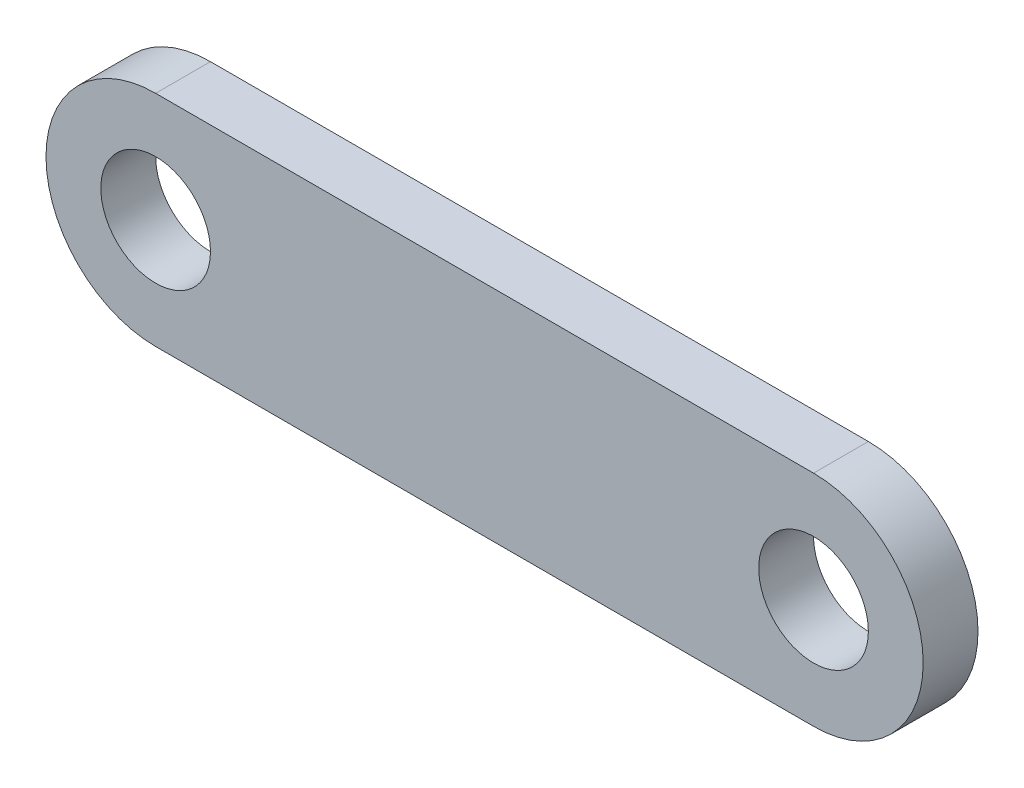
ISO-10303-21;
HEADER;
FILE_DESCRIPTION(('STEP AP214'),'2;1');
FILE_NAME('part.step','',(''),(''),'','','');
FILE_SCHEMA(('AUTOMOTIVE_DESIGN { 1 0 10303 214 1 1 1 1 }'));
ENDSEC;
DATA;
#1=APPLICATION_CONTEXT('core data for automotive mechanical design processes');
#2=APPLICATION_PROTOCOL_DEFINITION('international standard','automotive_design',2000,#1);
#3=PRODUCT_CONTEXT('',#1,'mechanical');
#4=PRODUCT('Part','Part','',(#3));
#5=PRODUCT_RELATED_PRODUCT_CATEGORY('part','',(#4));
#6=PRODUCT_DEFINITION_FORMATION('','',#4);
#7=PRODUCT_DEFINITION_CONTEXT('part definition',#1,'design');
#8=PRODUCT_DEFINITION('design','',#6,#7);
#9=PRODUCT_DEFINITION_SHAPE('','',#8);
#10=(LENGTH_UNIT() NAMED_UNIT(*) SI_UNIT(.MILLI.,.METRE.));
#11=(NAMED_UNIT(*) PLANE_ANGLE_UNIT() SI_UNIT($,.RADIAN.));
#12=(NAMED_UNIT(*) SI_UNIT($,.STERADIAN.) SOLID_ANGLE_UNIT());
#13=UNCERTAINTY_MEASURE_WITH_UNIT(LENGTH_MEASURE(1.E-05),#10,'distance_accuracy_value','');
#14=(GEOMETRIC_REPRESENTATION_CONTEXT(3) GLOBAL_UNCERTAINTY_ASSIGNED_CONTEXT((#13)) GLOBAL_UNIT_ASSIGNED_CONTEXT((#10,
#11,#12)) REPRESENTATION_CONTEXT('',''));
#15=CARTESIAN_POINT('',(0.,0.,0.));
#16=DIRECTION('',(0.,0.,1.));
#17=DIRECTION('',(1.,0.,0.));
#18=AXIS2_PLACEMENT_3D('',#15,#16,#17);
#19=CARTESIAN_POINT('',(0.,0.,5.));
#20=DIRECTION('',(0.,0.,1.));
#21=DIRECTION('',(1.,0.,0.));
#22=AXIS2_PLACEMENT_3D('',#19,#20,#21);
#23=PLANE('',#22);
#24=CARTESIAN_POINT('',(0.,0.,5.));
#25=DIRECTION('',(0.,0.,1.));
#26=DIRECTION('',(1.,0.,0.));
#27=AXIS2_PLACEMENT_3D('',#24,#25,#26);
#28=CIRCLE('',#27,5.);
#29=CARTESIAN_POINT('',(5.,0.,5.));
#30=VERTEX_POINT('',#29);
#31=EDGE_CURVE('E102',#30,#30,#28,.T.);
#32=ORIENTED_EDGE('',*,*,#31,.F.);
#33=EDGE_LOOP('',(#32));
#34=FACE_BOUND('',#33,.T.);
#35=CARTESIAN_POINT('',(0.,0.,5.));
#36=DIRECTION('',(0.,0.,1.));
#37=DIRECTION('',(1.,0.,0.));
#38=AXIS2_PLACEMENT_3D('',#35,#36,#37);
#39=CIRCLE('',#38,10.);
#40=CARTESIAN_POINT('',(0.,10.,5.));
#41=VERTEX_POINT('',#40);
#42=CARTESIAN_POINT('',(0.,-10.,5.));
#43=VERTEX_POINT('',#42);
#44=EDGE_CURVE('E87',#41,#43,#39,.T.);
#45=ORIENTED_EDGE('',*,*,#44,.T.);
#46=DIRECTION('',(1.,0.,0.));
#47=VECTOR('',#46,1.);
#48=CARTESIAN_POINT('',(0.,-10.,5.));
#49=LINE('',#48,#47);
#50=CARTESIAN_POINT('',(60.,-10.,5.));
#51=VERTEX_POINT('',#50);
#52=EDGE_CURVE('E82',#43,#51,#49,.T.);
#53=ORIENTED_EDGE('',*,*,#52,.T.);
#54=CARTESIAN_POINT('',(60.,0.,5.));
#55=DIRECTION('',(0.,0.,1.));
#56=DIRECTION('',(1.,0.,0.));
#57=AXIS2_PLACEMENT_3D('',#54,#55,#56);
#58=CIRCLE('',#57,10.);
#59=CARTESIAN_POINT('',(60.,10.,5.));
#60=VERTEX_POINT('',#59);
#61=EDGE_CURVE('E85',#51,#60,#58,.T.);
#62=ORIENTED_EDGE('',*,*,#61,.T.);
#63=DIRECTION('',(-1.,0.,0.));
#64=VECTOR('',#63,1.);
#65=CARTESIAN_POINT('',(0.,10.,5.));
#66=LINE('',#65,#64);
#67=EDGE_CURVE('E52',#60,#41,#66,.T.);
#68=ORIENTED_EDGE('',*,*,#67,.T.);
#69=EDGE_LOOP('',(#45,#53,#62,#68));
#70=FACE_BOUND('',#69,.T.);
#71=CARTESIAN_POINT('',(60.,0.,5.));
#72=DIRECTION('',(0.,0.,1.));
#73=DIRECTION('',(1.,0.,0.));
#74=AXIS2_PLACEMENT_3D('',#71,#72,#73);
#75=CIRCLE('',#74,5.);
#76=CARTESIAN_POINT('',(65.,0.,5.));
#77=VERTEX_POINT('',#76);
#78=EDGE_CURVE('E117',#77,#77,#75,.T.);
#79=ORIENTED_EDGE('',*,*,#78,.F.);
#80=EDGE_LOOP('',(#79));
#81=FACE_BOUND('',#80,.T.);
#82=ADVANCED_FACE('F35',(#34,#70,#81),#23,.T.);
#83=CARTESIAN_POINT('',(0.,0.,0.));
#84=DIRECTION('',(0.,0.,1.));
#85=DIRECTION('',(1.,0.,0.));
#86=AXIS2_PLACEMENT_3D('',#83,#84,#85);
#87=PLANE('',#86);
#88=CARTESIAN_POINT('',(0.,0.,0.));
#89=DIRECTION('',(0.,0.,1.));
#90=DIRECTION('',(1.,0.,0.));
#91=AXIS2_PLACEMENT_3D('',#88,#89,#90);
#92=CIRCLE('',#91,10.);
#93=CARTESIAN_POINT('',(0.,10.,0.));
#94=VERTEX_POINT('',#93);
#95=CARTESIAN_POINT('',(0.,-10.,0.));
#96=VERTEX_POINT('',#95);
#97=EDGE_CURVE('E99',#94,#96,#92,.T.);
#98=ORIENTED_EDGE('',*,*,#97,.F.);
#99=DIRECTION('',(-1.,0.,0.));
#100=VECTOR('',#99,1.);
#101=CARTESIAN_POINT('',(0.,10.,0.));
#102=LINE('',#101,#100);
#103=CARTESIAN_POINT('',(60.,10.,0.));
#104=VERTEX_POINT('',#103);
#105=EDGE_CURVE('E75',#104,#94,#102,.T.);
#106=ORIENTED_EDGE('',*,*,#105,.F.);
#107=CARTESIAN_POINT('',(60.,0.,0.));
#108=DIRECTION('',(0.,0.,1.));
#109=DIRECTION('',(1.,0.,0.));
#110=AXIS2_PLACEMENT_3D('',#107,#108,#109);
#111=CIRCLE('',#110,10.);
#112=CARTESIAN_POINT('',(60.,-10.,0.));
#113=VERTEX_POINT('',#112);
#114=EDGE_CURVE('E69',#113,#104,#111,.T.);
#115=ORIENTED_EDGE('',*,*,#114,.F.);
#116=DIRECTION('',(1.,0.,0.));
#117=VECTOR('',#116,1.);
#118=CARTESIAN_POINT('',(0.,-10.,0.));
#119=LINE('',#118,#117);
#120=EDGE_CURVE('E91',#96,#113,#119,.T.);
#121=ORIENTED_EDGE('',*,*,#120,.F.);
#122=EDGE_LOOP('',(#98,#106,#115,#121));
#123=FACE_BOUND('',#122,.T.);
#124=CARTESIAN_POINT('',(0.,0.,0.));
#125=DIRECTION('',(0.,0.,1.));
#126=DIRECTION('',(1.,0.,0.));
#127=AXIS2_PLACEMENT_3D('',#124,#125,#126);
#128=CIRCLE('',#127,5.);
#129=CARTESIAN_POINT('',(5.,0.,0.));
#130=VERTEX_POINT('',#129);
#131=EDGE_CURVE('E114',#130,#130,#128,.T.);
#132=ORIENTED_EDGE('',*,*,#131,.T.);
#133=EDGE_LOOP('',(#132));
#134=FACE_BOUND('',#133,.T.);
#135=CARTESIAN_POINT('',(60.,0.,0.));
#136=DIRECTION('',(0.,0.,1.));
#137=DIRECTION('',(1.,0.,0.));
#138=AXIS2_PLACEMENT_3D('',#135,#136,#137);
#139=CIRCLE('',#138,5.);
#140=CARTESIAN_POINT('',(65.,0.,0.));
#141=VERTEX_POINT('',#140);
#142=EDGE_CURVE('E120',#141,#141,#139,.T.);
#143=ORIENTED_EDGE('',*,*,#142,.T.);
#144=EDGE_LOOP('',(#143));
#145=FACE_BOUND('',#144,.T.);
#146=ADVANCED_FACE('F110',(#123,#134,#145),#87,.F.);
#147=CARTESIAN_POINT('',(0.,0.,5.));
#148=DIRECTION('',(0.,0.,-1.));
#149=DIRECTION('',(-1.,0.,0.));
#150=AXIS2_PLACEMENT_3D('',#147,#148,#149);
#151=CYLINDRICAL_SURFACE('',#150,10.);
#152=ORIENTED_EDGE('',*,*,#97,.T.);
#153=DIRECTION('',(0.,0.,-1.));
#154=VECTOR('',#153,1.);
#155=CARTESIAN_POINT('',(0.,-10.,5.));
#156=LINE('',#155,#154);
#157=EDGE_CURVE('E11',#43,#96,#156,.T.);
#158=ORIENTED_EDGE('',*,*,#157,.F.);
#159=ORIENTED_EDGE('',*,*,#44,.F.);
#160=DIRECTION('',(0.,0.,-1.));
#161=VECTOR('',#160,1.);
#162=CARTESIAN_POINT('',(0.,10.,5.));
#163=LINE('',#162,#161);
#164=EDGE_CURVE('E95',#41,#94,#163,.T.);
#165=ORIENTED_EDGE('',*,*,#164,.T.);
#166=EDGE_LOOP('',(#152,#158,#159,#165));
#167=FACE_BOUND('',#166,.T.);
#168=ADVANCED_FACE('F37',(#167),#151,.T.);
#169=CARTESIAN_POINT('',(0.,-10.,5.));
#170=DIRECTION('',(0.,1.,0.));
#171=DIRECTION('',(0.,0.,1.));
#172=AXIS2_PLACEMENT_3D('',#169,#170,#171);
#173=PLANE('',#172);
#174=ORIENTED_EDGE('',*,*,#120,.T.);
#175=DIRECTION('',(0.,0.,-1.));
#176=VECTOR('',#175,1.);
#177=CARTESIAN_POINT('',(60.,-10.,5.));
#178=LINE('',#177,#176);
#179=EDGE_CURVE('E44',#51,#113,#178,.T.);
#180=ORIENTED_EDGE('',*,*,#179,.F.);
#181=ORIENTED_EDGE('',*,*,#52,.F.);
#182=ORIENTED_EDGE('',*,*,#157,.T.);
#183=EDGE_LOOP('',(#174,#180,#181,#182));
#184=FACE_BOUND('',#183,.T.);
#185=ADVANCED_FACE('F90',(#184),#173,.F.);
#186=CARTESIAN_POINT('',(60.,0.,5.));
#187=DIRECTION('',(0.,0.,-1.));
#188=DIRECTION('',(-1.,0.,0.));
#189=AXIS2_PLACEMENT_3D('',#186,#187,#188);
#190=CYLINDRICAL_SURFACE('',#189,10.);
#191=ORIENTED_EDGE('',*,*,#114,.T.);
#192=DIRECTION('',(0.,0.,-1.));
#193=VECTOR('',#192,1.);
#194=CARTESIAN_POINT('',(60.,10.,5.));
#195=LINE('',#194,#193);
#196=EDGE_CURVE('E92',#60,#104,#195,.T.);
#197=ORIENTED_EDGE('',*,*,#196,.F.);
#198=ORIENTED_EDGE('',*,*,#61,.F.);
#199=ORIENTED_EDGE('',*,*,#179,.T.);
#200=EDGE_LOOP('',(#191,#197,#198,#199));
#201=FACE_BOUND('',#200,.T.);
#202=ADVANCED_FACE('F93',(#201),#190,.T.);
#203=CARTESIAN_POINT('',(0.,10.,5.));
#204=DIRECTION('',(0.,-1.,0.));
#205=DIRECTION('',(0.,0.,-1.));
#206=AXIS2_PLACEMENT_3D('',#203,#204,#205);
#207=PLANE('',#206);
#208=ORIENTED_EDGE('',*,*,#105,.T.);
#209=ORIENTED_EDGE('',*,*,#164,.F.);
#210=ORIENTED_EDGE('',*,*,#67,.F.);
#211=ORIENTED_EDGE('',*,*,#196,.T.);
#212=EDGE_LOOP('',(#208,#209,#210,#211));
#213=FACE_BOUND('',#212,.T.);
#214=ADVANCED_FACE('F107',(#213),#207,.F.);
#215=CARTESIAN_POINT('',(0.,0.,5.));
#216=DIRECTION('',(0.,0.,-1.));
#217=DIRECTION('',(-1.,0.,0.));
#218=AXIS2_PLACEMENT_3D('',#215,#216,#217);
#219=CYLINDRICAL_SURFACE('',#218,5.);
#220=ORIENTED_EDGE('',*,*,#31,.T.);
#221=EDGE_LOOP('',(#220));
#222=FACE_BOUND('',#221,.T.);
#223=ORIENTED_EDGE('',*,*,#131,.F.);
#224=EDGE_LOOP('',(#223));
#225=FACE_BOUND('',#224,.T.);
#226=ADVANCED_FACE('F137',(#222,#225),#219,.F.);
#227=CARTESIAN_POINT('',(60.,0.,5.));
#228=DIRECTION('',(0.,0.,-1.));
#229=DIRECTION('',(-1.,0.,0.));
#230=AXIS2_PLACEMENT_3D('',#227,#228,#229);
#231=CYLINDRICAL_SURFACE('',#230,5.);
#232=ORIENTED_EDGE('',*,*,#78,.T.);
#233=EDGE_LOOP('',(#232));
#234=FACE_BOUND('',#233,.T.);
#235=ORIENTED_EDGE('',*,*,#142,.F.);
#236=EDGE_LOOP('',(#235));
#237=FACE_BOUND('',#236,.T.);
#238=ADVANCED_FACE('F126',(#234,#237),#231,.F.);
#239=CLOSED_SHELL('',(#82,#146,#168,#185,#202,#214,#226,#238));
#240=MANIFOLD_SOLID_BREP('B2',#239);
#241=ADVANCED_BREP_SHAPE_REPRESENTATION('',(#18,#240),#14);
#242=SHAPE_DEFINITION_REPRESENTATION(#9,#241);
ENDSEC;
END-ISO-10303-21;
